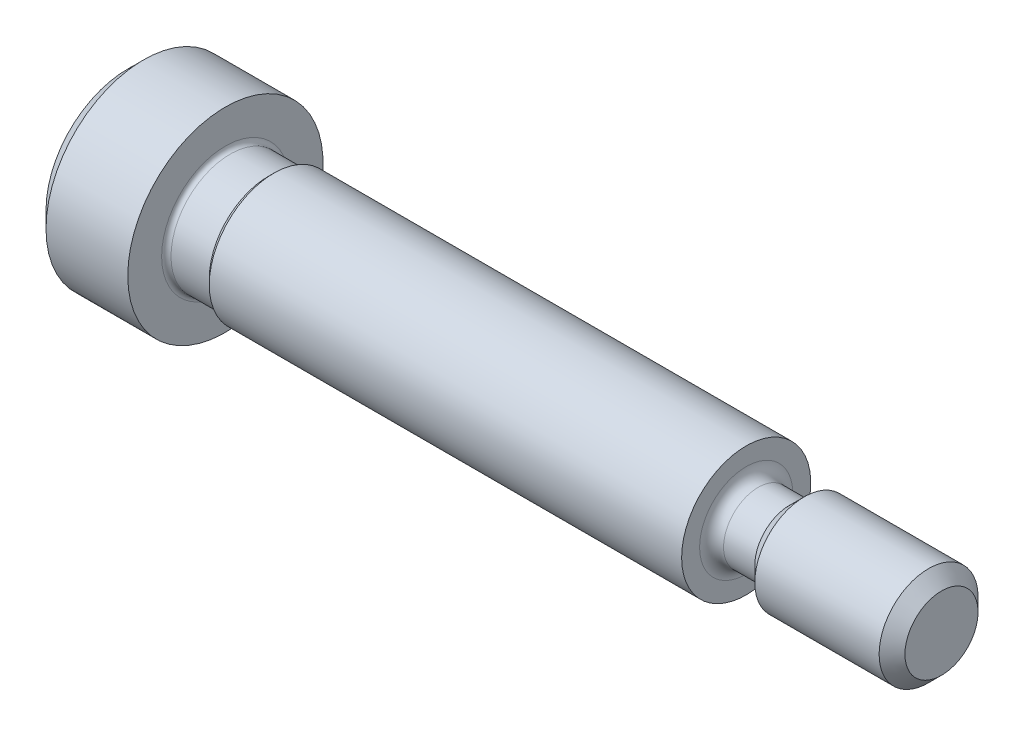
ISO-10303-21;
HEADER;
FILE_DESCRIPTION(('STEP AP214'),'2;1');
FILE_NAME('part.step','',(''),(''),'','','');
FILE_SCHEMA(('AUTOMOTIVE_DESIGN { 1 0 10303 214 1 1 1 1 }'));
ENDSEC;
DATA;
#1=APPLICATION_CONTEXT('core data for automotive mechanical design processes');
#2=APPLICATION_PROTOCOL_DEFINITION('international standard','automotive_design',2000,#1);
#3=PRODUCT_CONTEXT('',#1,'mechanical');
#4=PRODUCT('Part','Part','',(#3));
#5=PRODUCT_RELATED_PRODUCT_CATEGORY('part','',(#4));
#6=PRODUCT_DEFINITION_FORMATION('','',#4);
#7=PRODUCT_DEFINITION_CONTEXT('part definition',#1,'design');
#8=PRODUCT_DEFINITION('design','',#6,#7);
#9=PRODUCT_DEFINITION_SHAPE('','',#8);
#10=(LENGTH_UNIT() NAMED_UNIT(*) SI_UNIT(.MILLI.,.METRE.));
#11=(NAMED_UNIT(*) PLANE_ANGLE_UNIT() SI_UNIT($,.RADIAN.));
#12=(NAMED_UNIT(*) SI_UNIT($,.STERADIAN.) SOLID_ANGLE_UNIT());
#13=UNCERTAINTY_MEASURE_WITH_UNIT(LENGTH_MEASURE(1.E-05),#10,'distance_accuracy_value','');
#14=(GEOMETRIC_REPRESENTATION_CONTEXT(3) GLOBAL_UNCERTAINTY_ASSIGNED_CONTEXT((#13)) GLOBAL_UNIT_ASSIGNED_CONTEXT((#10,
#11,#12)) REPRESENTATION_CONTEXT('',''));
#15=CARTESIAN_POINT('',(0.,0.,0.));
#16=DIRECTION('',(0.,0.,1.));
#17=DIRECTION('',(1.,0.,0.));
#18=AXIS2_PLACEMENT_3D('',#15,#16,#17);
#19=CARTESIAN_POINT('',(0.,0.,0.));
#20=DIRECTION('',(-1.,0.,0.));
#21=DIRECTION('',(0.,0.,1.));
#22=AXIS2_PLACEMENT_3D('',#19,#20,#21);
#23=PLANE('',#22);
#24=CARTESIAN_POINT('',(0.,0.,0.));
#25=DIRECTION('',(-1.,0.,0.));
#26=DIRECTION('',(0.,0.,1.));
#27=AXIS2_PLACEMENT_3D('',#24,#25,#26);
#28=CIRCLE('',#27,3.9751);
#29=CARTESIAN_POINT('',(0.,0.,3.9751));
#30=VERTEX_POINT('',#29);
#31=EDGE_CURVE('E11',#30,#30,#28,.T.);
#32=ORIENTED_EDGE('',*,*,#31,.T.);
#33=EDGE_LOOP('',(#32));
#34=FACE_BOUND('',#33,.T.);
#35=DIRECTION('',(0.,-0.500000000000002,-0.866025403784438));
#36=VECTOR('',#35,1.);
#37=CARTESIAN_POINT('',(0.,-0.916543552338525,1.5875));
#38=LINE('',#37,#36);
#39=CARTESIAN_POINT('',(0.,-0.916543552338525,1.5875));
#40=VERTEX_POINT('',#39);
#41=CARTESIAN_POINT('',(0.,-1.83308710467706,0.));
#42=VERTEX_POINT('',#41);
#43=EDGE_CURVE('E44',#40,#42,#38,.T.);
#44=ORIENTED_EDGE('',*,*,#43,.T.);
#45=DIRECTION('',(0.,0.500000000000002,-0.866025403784437));
#46=VECTOR('',#45,1.);
#47=CARTESIAN_POINT('',(0.,-1.83308710467706,0.));
#48=LINE('',#47,#46);
#49=CARTESIAN_POINT('',(0.,-0.916543552338525,-1.5875));
#50=VERTEX_POINT('',#49);
#51=EDGE_CURVE('E473',#42,#50,#48,.T.);
#52=ORIENTED_EDGE('',*,*,#51,.T.);
#53=DIRECTION('',(0.,1.,0.));
#54=VECTOR('',#53,1.);
#55=CARTESIAN_POINT('',(0.,-0.916543552338525,-1.5875));
#56=LINE('',#55,#54);
#57=CARTESIAN_POINT('',(0.,0.916543552338522,-1.5875));
#58=VERTEX_POINT('',#57);
#59=EDGE_CURVE('E124',#50,#58,#56,.T.);
#60=ORIENTED_EDGE('',*,*,#59,.T.);
#61=DIRECTION('',(0.,0.500000000000005,0.866025403784435));
#62=VECTOR('',#61,1.);
#63=CARTESIAN_POINT('',(0.,0.916543552338522,-1.5875));
#64=LINE('',#63,#62);
#65=CARTESIAN_POINT('',(0.,1.83308710467707,0.));
#66=VERTEX_POINT('',#65);
#67=EDGE_CURVE('E476',#58,#66,#64,.T.);
#68=ORIENTED_EDGE('',*,*,#67,.T.);
#69=DIRECTION('',(0.,-0.500000000000004,0.866025403784436));
#70=VECTOR('',#69,1.);
#71=CARTESIAN_POINT('',(0.,1.83308710467707,0.));
#72=LINE('',#71,#70);
#73=CARTESIAN_POINT('',(0.,0.916543552338522,1.5875));
#74=VERTEX_POINT('',#73);
#75=EDGE_CURVE('E478',#66,#74,#72,.T.);
#76=ORIENTED_EDGE('',*,*,#75,.T.);
#77=DIRECTION('',(0.,-1.,0.));
#78=VECTOR('',#77,1.);
#79=CARTESIAN_POINT('',(0.,0.916543552338522,1.5875));
#80=LINE('',#79,#78);
#81=EDGE_CURVE('E480',#74,#40,#80,.T.);
#82=ORIENTED_EDGE('',*,*,#81,.T.);
#83=EDGE_LOOP('',(#44,#52,#60,#68,#76,#82));
#84=FACE_BOUND('',#83,.T.);
#85=ADVANCED_FACE('F30',(#34,#84),#23,.T.);
#86=CARTESIAN_POINT('',(0.,0.,0.));
#87=DIRECTION('',(1.,0.,0.));
#88=DIRECTION('',(0.,0.,-1.));
#89=AXIS2_PLACEMENT_3D('',#86,#87,#88);
#90=CONICAL_SURFACE('',#89,3.9751,0.78539816339745);
#91=CARTESIAN_POINT('',(0.787399999999999,0.,0.));
#92=DIRECTION('',(-1.,0.,0.));
#93=DIRECTION('',(0.,0.,1.));
#94=AXIS2_PLACEMENT_3D('',#91,#92,#93);
#95=CIRCLE('',#94,4.7625);
#96=CARTESIAN_POINT('',(0.787399999999999,0.,4.7625));
#97=VERTEX_POINT('',#96);
#98=EDGE_CURVE('E37',#97,#97,#95,.T.);
#99=ORIENTED_EDGE('',*,*,#98,.T.);
#100=EDGE_LOOP('',(#99));
#101=FACE_BOUND('',#100,.T.);
#102=ORIENTED_EDGE('',*,*,#31,.F.);
#103=EDGE_LOOP('',(#102));
#104=FACE_BOUND('',#103,.T.);
#105=ADVANCED_FACE('F176',(#101,#104),#90,.T.);
#106=CARTESIAN_POINT('',(-6.34999999999999,0.,0.));
#107=DIRECTION('',(-1.,0.,0.));
#108=DIRECTION('',(0.,0.,1.));
#109=AXIS2_PLACEMENT_3D('',#106,#107,#108);
#110=CYLINDRICAL_SURFACE('',#109,4.7625);
#111=CARTESIAN_POINT('',(4.7752,0.,0.));
#112=DIRECTION('',(-1.,0.,0.));
#113=DIRECTION('',(0.,0.,1.));
#114=AXIS2_PLACEMENT_3D('',#111,#112,#113);
#115=CIRCLE('',#114,4.7625);
#116=CARTESIAN_POINT('',(4.7752,0.,4.7625));
#117=VERTEX_POINT('',#116);
#118=EDGE_CURVE('E171',#117,#117,#115,.T.);
#119=ORIENTED_EDGE('',*,*,#118,.T.);
#120=EDGE_LOOP('',(#119));
#121=FACE_BOUND('',#120,.T.);
#122=ORIENTED_EDGE('',*,*,#98,.F.);
#123=EDGE_LOOP('',(#122));
#124=FACE_BOUND('',#123,.T.);
#125=ADVANCED_FACE('F179',(#121,#124),#110,.T.);
#126=CARTESIAN_POINT('',(4.7752,4.7625,0.));
#127=DIRECTION('',(1.,0.,0.));
#128=DIRECTION('',(0.,0.,-1.));
#129=AXIS2_PLACEMENT_3D('',#126,#127,#128);
#130=PLANE('',#129);
#131=CARTESIAN_POINT('',(4.7752,0.,0.));
#132=DIRECTION('',(-1.,0.,0.));
#133=DIRECTION('',(0.,0.,1.));
#134=AXIS2_PLACEMENT_3D('',#131,#132,#133);
#135=CIRCLE('',#134,3.1115);
#136=CARTESIAN_POINT('',(4.7752,0.,3.1115));
#137=VERTEX_POINT('',#136);
#138=EDGE_CURVE('E168',#137,#137,#135,.T.);
#139=ORIENTED_EDGE('',*,*,#138,.T.);
#140=EDGE_LOOP('',(#139));
#141=FACE_BOUND('',#140,.T.);
#142=ORIENTED_EDGE('',*,*,#118,.F.);
#143=EDGE_LOOP('',(#142));
#144=FACE_BOUND('',#143,.T.);
#145=ADVANCED_FACE('F181',(#141,#144),#130,.T.);
#146=CARTESIAN_POINT('',(5.0038,0.,0.));
#147=DIRECTION('',(-1.,0.,0.));
#148=DIRECTION('',(0.,0.,1.));
#149=AXIS2_PLACEMENT_3D('',#146,#147,#148);
#150=TOROIDAL_SURFACE('',#149,3.1115,0.2286);
#151=ORIENTED_EDGE('',*,*,#138,.F.);
#152=EDGE_LOOP('',(#151));
#153=FACE_BOUND('',#152,.T.);
#154=CARTESIAN_POINT('',(5.0038,0.,0.));
#155=DIRECTION('',(-1.,0.,0.));
#156=DIRECTION('',(0.,0.,1.));
#157=AXIS2_PLACEMENT_3D('',#154,#155,#156);
#158=CIRCLE('',#157,2.8829);
#159=CARTESIAN_POINT('',(5.0038,0.,2.8829));
#160=VERTEX_POINT('',#159);
#161=EDGE_CURVE('E165',#160,#160,#158,.T.);
#162=ORIENTED_EDGE('',*,*,#161,.T.);
#163=EDGE_LOOP('',(#162));
#164=FACE_BOUND('',#163,.T.);
#165=ADVANCED_FACE('F188',(#153,#164),#150,.F.);
#166=CARTESIAN_POINT('',(-6.34999999999999,0.,0.));
#167=DIRECTION('',(-1.,0.,0.));
#168=DIRECTION('',(0.,0.,1.));
#169=AXIS2_PLACEMENT_3D('',#166,#167,#168);
#170=CYLINDRICAL_SURFACE('',#169,2.8829);
#171=CARTESIAN_POINT('',(6.8707,0.,0.));
#172=DIRECTION('',(-1.,0.,0.));
#173=DIRECTION('',(0.,0.,1.));
#174=AXIS2_PLACEMENT_3D('',#171,#172,#173);
#175=CIRCLE('',#174,2.8829);
#176=CARTESIAN_POINT('',(6.8707,0.,2.8829));
#177=VERTEX_POINT('',#176);
#178=EDGE_CURVE('E162',#177,#177,#175,.T.);
#179=ORIENTED_EDGE('',*,*,#178,.T.);
#180=EDGE_LOOP('',(#179));
#181=FACE_BOUND('',#180,.T.);
#182=ORIENTED_EDGE('',*,*,#161,.F.);
#183=EDGE_LOOP('',(#182));
#184=FACE_BOUND('',#183,.T.);
#185=ADVANCED_FACE('F221',(#181,#184),#170,.T.);
#186=CARTESIAN_POINT('',(6.8707,0.,0.));
#187=DIRECTION('',(1.,0.,0.));
#188=DIRECTION('',(0.,0.,-1.));
#189=AXIS2_PLACEMENT_3D('',#186,#187,#188);
#190=CONICAL_SURFACE('',#189,2.8829,0.785398163397452);
#191=CARTESIAN_POINT('',(7.1374,0.,0.));
#192=DIRECTION('',(-1.,0.,0.));
#193=DIRECTION('',(0.,0.,1.));
#194=AXIS2_PLACEMENT_3D('',#191,#192,#193);
#195=CIRCLE('',#194,3.1496);
#196=CARTESIAN_POINT('',(7.1374,0.,3.1496));
#197=VERTEX_POINT('',#196);
#198=EDGE_CURVE('E159',#197,#197,#195,.T.);
#199=ORIENTED_EDGE('',*,*,#198,.T.);
#200=EDGE_LOOP('',(#199));
#201=FACE_BOUND('',#200,.T.);
#202=ORIENTED_EDGE('',*,*,#178,.F.);
#203=EDGE_LOOP('',(#202));
#204=FACE_BOUND('',#203,.T.);
#205=ADVANCED_FACE('F231',(#201,#204),#190,.T.);
#206=CARTESIAN_POINT('',(-6.34999999999999,0.,0.));
#207=DIRECTION('',(-1.,0.,0.));
#208=DIRECTION('',(0.,0.,1.));
#209=AXIS2_PLACEMENT_3D('',#206,#207,#208);
#210=CYLINDRICAL_SURFACE('',#209,3.1496);
#211=CARTESIAN_POINT('',(30.1752,0.,0.));
#212=DIRECTION('',(-1.,0.,0.));
#213=DIRECTION('',(0.,0.,1.));
#214=AXIS2_PLACEMENT_3D('',#211,#212,#213);
#215=CIRCLE('',#214,3.1496);
#216=CARTESIAN_POINT('',(30.1752,0.,3.1496));
#217=VERTEX_POINT('',#216);
#218=EDGE_CURVE('E156',#217,#217,#215,.T.);
#219=ORIENTED_EDGE('',*,*,#218,.T.);
#220=EDGE_LOOP('',(#219));
#221=FACE_BOUND('',#220,.T.);
#222=ORIENTED_EDGE('',*,*,#198,.F.);
#223=EDGE_LOOP('',(#222));
#224=FACE_BOUND('',#223,.T.);
#225=ADVANCED_FACE('F241',(#221,#224),#210,.T.);
#226=CARTESIAN_POINT('',(30.1752,3.1496,0.));
#227=DIRECTION('',(1.,0.,0.));
#228=DIRECTION('',(0.,0.,-1.));
#229=AXIS2_PLACEMENT_3D('',#226,#227,#228);
#230=PLANE('',#229);
#231=CARTESIAN_POINT('',(30.1752,0.,0.));
#232=DIRECTION('',(-1.,0.,0.));
#233=DIRECTION('',(0.,0.,1.));
#234=AXIS2_PLACEMENT_3D('',#231,#232,#233);
#235=CIRCLE('',#234,2.2733);
#236=CARTESIAN_POINT('',(30.1752,0.,2.2733));
#237=VERTEX_POINT('',#236);
#238=EDGE_CURVE('E153',#237,#237,#235,.T.);
#239=ORIENTED_EDGE('',*,*,#238,.T.);
#240=EDGE_LOOP('',(#239));
#241=FACE_BOUND('',#240,.T.);
#242=ORIENTED_EDGE('',*,*,#218,.F.);
#243=EDGE_LOOP('',(#242));
#244=FACE_BOUND('',#243,.T.);
#245=ADVANCED_FACE('F251',(#241,#244),#230,.T.);
#246=CARTESIAN_POINT('',(30.7594,0.,0.));
#247=DIRECTION('',(-1.,0.,0.));
#248=DIRECTION('',(0.,0.,1.));
#249=AXIS2_PLACEMENT_3D('',#246,#247,#248);
#250=TOROIDAL_SURFACE('',#249,2.2733,0.584200000000002);
#251=CARTESIAN_POINT('',(30.7594,0.,0.));
#252=DIRECTION('',(-1.,0.,0.));
#253=DIRECTION('',(0.,0.,1.));
#254=AXIS2_PLACEMENT_3D('',#251,#252,#253);
#255=CIRCLE('',#254,1.6891);
#256=CARTESIAN_POINT('',(30.7594,0.,1.6891));
#257=VERTEX_POINT('',#256);
#258=EDGE_CURVE('E150',#257,#257,#255,.T.);
#259=ORIENTED_EDGE('',*,*,#258,.T.);
#260=EDGE_LOOP('',(#259));
#261=FACE_BOUND('',#260,.T.);
#262=ORIENTED_EDGE('',*,*,#238,.F.);
#263=EDGE_LOOP('',(#262));
#264=FACE_BOUND('',#263,.T.);
#265=ADVANCED_FACE('F261',(#261,#264),#250,.F.);
#266=CARTESIAN_POINT('',(-6.34999999999999,0.,0.));
#267=DIRECTION('',(-1.,0.,0.));
#268=DIRECTION('',(0.,0.,1.));
#269=AXIS2_PLACEMENT_3D('',#266,#267,#268);
#270=CYLINDRICAL_SURFACE('',#269,1.6891);
#271=CARTESIAN_POINT('',(32.2834,0.,0.));
#272=DIRECTION('',(-1.,0.,0.));
#273=DIRECTION('',(0.,0.,1.));
#274=AXIS2_PLACEMENT_3D('',#271,#272,#273);
#275=CIRCLE('',#274,1.6891);
#276=CARTESIAN_POINT('',(32.2834,0.,1.6891));
#277=VERTEX_POINT('',#276);
#278=EDGE_CURVE('E147',#277,#277,#275,.T.);
#279=ORIENTED_EDGE('',*,*,#278,.T.);
#280=EDGE_LOOP('',(#279));
#281=FACE_BOUND('',#280,.T.);
#282=ORIENTED_EDGE('',*,*,#258,.F.);
#283=EDGE_LOOP('',(#282));
#284=FACE_BOUND('',#283,.T.);
#285=ADVANCED_FACE('F271',(#281,#284),#270,.T.);
#286=CARTESIAN_POINT('',(32.2834,0.,0.));
#287=DIRECTION('',(1.,0.,0.));
#288=DIRECTION('',(0.,0.,-1.));
#289=AXIS2_PLACEMENT_3D('',#286,#287,#288);
#290=CONICAL_SURFACE('',#289,1.6891,0.78539816339745);
#291=CARTESIAN_POINT('',(33.0073,0.,0.));
#292=DIRECTION('',(-1.,0.,0.));
#293=DIRECTION('',(0.,0.,1.));
#294=AXIS2_PLACEMENT_3D('',#291,#292,#293);
#295=CIRCLE('',#294,2.413);
#296=CARTESIAN_POINT('',(33.0073,0.,2.413));
#297=VERTEX_POINT('',#296);
#298=EDGE_CURVE('E144',#297,#297,#295,.T.);
#299=ORIENTED_EDGE('',*,*,#298,.T.);
#300=EDGE_LOOP('',(#299));
#301=FACE_BOUND('',#300,.T.);
#302=ORIENTED_EDGE('',*,*,#278,.F.);
#303=EDGE_LOOP('',(#302));
#304=FACE_BOUND('',#303,.T.);
#305=ADVANCED_FACE('F281',(#301,#304),#290,.T.);
#306=CARTESIAN_POINT('',(-6.34999999999999,0.,0.));
#307=DIRECTION('',(-1.,0.,0.));
#308=DIRECTION('',(0.,0.,1.));
#309=AXIS2_PLACEMENT_3D('',#306,#307,#308);
#310=CYLINDRICAL_SURFACE('',#309,2.413);
#311=CARTESIAN_POINT('',(39.07028,0.,0.));
#312=DIRECTION('',(-1.,0.,0.));
#313=DIRECTION('',(0.,0.,1.));
#314=AXIS2_PLACEMENT_3D('',#311,#312,#313);
#315=CIRCLE('',#314,2.413);
#316=CARTESIAN_POINT('',(39.07028,0.,2.413));
#317=VERTEX_POINT('',#316);
#318=EDGE_CURVE('E141',#317,#317,#315,.T.);
#319=ORIENTED_EDGE('',*,*,#318,.T.);
#320=EDGE_LOOP('',(#319));
#321=FACE_BOUND('',#320,.T.);
#322=ORIENTED_EDGE('',*,*,#298,.F.);
#323=EDGE_LOOP('',(#322));
#324=FACE_BOUND('',#323,.T.);
#325=ADVANCED_FACE('F291',(#321,#324),#310,.T.);
#326=CARTESIAN_POINT('',(39.07028,0.,0.));
#327=DIRECTION('',(-1.,0.,0.));
#328=DIRECTION('',(0.,0.,1.));
#329=AXIS2_PLACEMENT_3D('',#326,#327,#328);
#330=CONICAL_SURFACE('',#329,2.413,0.785398163397455);
#331=CARTESIAN_POINT('',(39.7002,0.,0.));
#332=DIRECTION('',(-1.,0.,0.));
#333=DIRECTION('',(0.,0.,1.));
#334=AXIS2_PLACEMENT_3D('',#331,#332,#333);
#335=CIRCLE('',#334,1.78308);
#336=CARTESIAN_POINT('',(39.7002,0.,1.78308));
#337=VERTEX_POINT('',#336);
#338=EDGE_CURVE('E137',#337,#337,#335,.T.);
#339=ORIENTED_EDGE('',*,*,#338,.T.);
#340=EDGE_LOOP('',(#339));
#341=FACE_BOUND('',#340,.T.);
#342=ORIENTED_EDGE('',*,*,#318,.F.);
#343=EDGE_LOOP('',(#342));
#344=FACE_BOUND('',#343,.T.);
#345=ADVANCED_FACE('F301',(#341,#344),#330,.T.);
#346=CARTESIAN_POINT('',(39.7002,1.78308,0.));
#347=DIRECTION('',(1.,0.,0.));
#348=DIRECTION('',(0.,0.,-1.));
#349=AXIS2_PLACEMENT_3D('',#346,#347,#348);
#350=PLANE('',#349);
#351=ORIENTED_EDGE('',*,*,#338,.F.);
#352=EDGE_LOOP('',(#351));
#353=FACE_BOUND('',#352,.T.);
#354=ADVANCED_FACE('F310',(#353),#350,.T.);
#355=CARTESIAN_POINT('',(2.3876,-1.83308710467706,0.));
#356=DIRECTION('',(0.,0.866025403784437,0.500000000000002));
#357=DIRECTION('',(0.,-0.500000000000003,0.866025403784437));
#358=AXIS2_PLACEMENT_3D('',#355,#356,#357);
#359=PLANE('',#358);
#360=DIRECTION('',(0.,0.500000000000002,-0.866025403784437));
#361=VECTOR('',#360,1.);
#362=CARTESIAN_POINT('',(2.3876,-1.83308710467706,0.));
#363=LINE('',#362,#361);
#364=CARTESIAN_POINT('',(2.3876,-1.83308710467706,0.));
#365=VERTEX_POINT('',#364);
#366=CARTESIAN_POINT('',(2.3876,-1.37481532850779,-0.793750000000003));
#367=VERTEX_POINT('',#366);
#368=EDGE_CURVE('E52',#365,#367,#363,.T.);
#369=ORIENTED_EDGE('',*,*,#368,.T.);
#370=CARTESIAN_POINT('',(2.3876,-0.916543552338525,-1.5875));
#371=VERTEX_POINT('',#370);
#372=EDGE_CURVE('E102',#367,#371,#363,.T.);
#373=ORIENTED_EDGE('',*,*,#372,.T.);
#374=DIRECTION('',(-1.,0.,0.));
#375=VECTOR('',#374,1.);
#376=CARTESIAN_POINT('',(2.3876,-0.916543552338525,-1.5875));
#377=LINE('',#376,#375);
#378=EDGE_CURVE('E106',#371,#50,#377,.T.);
#379=ORIENTED_EDGE('',*,*,#378,.T.);
#380=ORIENTED_EDGE('',*,*,#51,.F.);
#381=DIRECTION('',(-1.,0.,0.));
#382=VECTOR('',#381,1.);
#383=CARTESIAN_POINT('',(2.3876,-1.83308710467706,0.));
#384=LINE('',#383,#382);
#385=EDGE_CURVE('E472',#365,#42,#384,.T.);
#386=ORIENTED_EDGE('',*,*,#385,.F.);
#387=EDGE_LOOP('',(#369,#373,#379,#380,#386));
#388=FACE_BOUND('',#387,.T.);
#389=ADVANCED_FACE('F104',(#388),#359,.T.);
#390=CARTESIAN_POINT('',(2.3876,-0.916543552338525,-1.5875));
#391=DIRECTION('',(0.,0.,1.));
#392=DIRECTION('',(0.,-1.,0.));
#393=AXIS2_PLACEMENT_3D('',#390,#391,#392);
#394=PLANE('',#393);
#395=DIRECTION('',(0.,1.,0.));
#396=VECTOR('',#395,1.);
#397=CARTESIAN_POINT('',(2.3876,-0.916543552338525,-1.5875));
#398=LINE('',#397,#396);
#399=CARTESIAN_POINT('',(2.3876,0.,-1.5875));
#400=VERTEX_POINT('',#399);
#401=EDGE_CURVE('E111',#371,#400,#398,.T.);
#402=ORIENTED_EDGE('',*,*,#401,.T.);
#403=CARTESIAN_POINT('',(2.3876,0.916543552338522,-1.5875));
#404=VERTEX_POINT('',#403);
#405=EDGE_CURVE('E119',#400,#404,#398,.T.);
#406=ORIENTED_EDGE('',*,*,#405,.T.);
#407=DIRECTION('',(-1.,0.,0.));
#408=VECTOR('',#407,1.);
#409=CARTESIAN_POINT('',(2.3876,0.916543552338522,-1.5875));
#410=LINE('',#409,#408);
#411=EDGE_CURVE('E126',#404,#58,#410,.T.);
#412=ORIENTED_EDGE('',*,*,#411,.T.);
#413=ORIENTED_EDGE('',*,*,#59,.F.);
#414=ORIENTED_EDGE('',*,*,#378,.F.);
#415=EDGE_LOOP('',(#402,#406,#412,#413,#414));
#416=FACE_BOUND('',#415,.T.);
#417=ADVANCED_FACE('F122',(#416),#394,.T.);
#418=CARTESIAN_POINT('',(2.3876,0.916543552338522,-1.5875));
#419=DIRECTION('',(0.,-0.866025403784436,0.500000000000005));
#420=DIRECTION('',(0.,-0.500000000000005,-0.866025403784436));
#421=AXIS2_PLACEMENT_3D('',#418,#419,#420);
#422=PLANE('',#421);
#423=DIRECTION('',(0.,0.500000000000005,0.866025403784435));
#424=VECTOR('',#423,1.);
#425=CARTESIAN_POINT('',(2.3876,0.916543552338522,-1.5875));
#426=LINE('',#425,#424);
#427=CARTESIAN_POINT('',(2.3876,1.37481532850779,-0.793750000000007));
#428=VERTEX_POINT('',#427);
#429=EDGE_CURVE('E496',#404,#428,#426,.T.);
#430=ORIENTED_EDGE('',*,*,#429,.T.);
#431=CARTESIAN_POINT('',(2.3876,1.83308710467707,0.));
#432=VERTEX_POINT('',#431);
#433=EDGE_CURVE('E118',#428,#432,#426,.T.);
#434=ORIENTED_EDGE('',*,*,#433,.T.);
#435=DIRECTION('',(-1.,0.,0.));
#436=VECTOR('',#435,1.);
#437=CARTESIAN_POINT('',(2.3876,1.83308710467707,0.));
#438=LINE('',#437,#436);
#439=EDGE_CURVE('E132',#432,#66,#438,.T.);
#440=ORIENTED_EDGE('',*,*,#439,.T.);
#441=ORIENTED_EDGE('',*,*,#67,.F.);
#442=ORIENTED_EDGE('',*,*,#411,.F.);
#443=EDGE_LOOP('',(#430,#434,#440,#441,#442));
#444=FACE_BOUND('',#443,.T.);
#445=ADVANCED_FACE('F334',(#444),#422,.T.);
#446=CARTESIAN_POINT('',(2.3876,1.83308710467707,0.));
#447=DIRECTION('',(0.,-0.866025403784436,-0.500000000000004));
#448=DIRECTION('',(0.,0.500000000000004,-0.866025403784436));
#449=AXIS2_PLACEMENT_3D('',#446,#447,#448);
#450=PLANE('',#449);
#451=DIRECTION('',(0.,-0.500000000000004,0.866025403784436));
#452=VECTOR('',#451,1.);
#453=CARTESIAN_POINT('',(2.3876,1.83308710467707,0.));
#454=LINE('',#453,#452);
#455=CARTESIAN_POINT('',(2.3876,1.37481532850779,0.793750000000006));
#456=VERTEX_POINT('',#455);
#457=EDGE_CURVE('E461',#432,#456,#454,.T.);
#458=ORIENTED_EDGE('',*,*,#457,.T.);
#459=CARTESIAN_POINT('',(2.3876,0.916543552338522,1.5875));
#460=VERTEX_POINT('',#459);
#461=EDGE_CURVE('E452',#456,#460,#454,.T.);
#462=ORIENTED_EDGE('',*,*,#461,.T.);
#463=DIRECTION('',(-1.,0.,0.));
#464=VECTOR('',#463,1.);
#465=CARTESIAN_POINT('',(2.3876,0.916543552338522,1.5875));
#466=LINE('',#465,#464);
#467=EDGE_CURVE('E466',#460,#74,#466,.T.);
#468=ORIENTED_EDGE('',*,*,#467,.T.);
#469=ORIENTED_EDGE('',*,*,#75,.F.);
#470=ORIENTED_EDGE('',*,*,#439,.F.);
#471=EDGE_LOOP('',(#458,#462,#468,#469,#470));
#472=FACE_BOUND('',#471,.T.);
#473=ADVANCED_FACE('F341',(#472),#450,.T.);
#474=CARTESIAN_POINT('',(2.3876,0.916543552338522,1.5875));
#475=DIRECTION('',(0.,0.,-1.));
#476=DIRECTION('',(-1.,0.,0.));
#477=AXIS2_PLACEMENT_3D('',#474,#475,#476);
#478=PLANE('',#477);
#479=DIRECTION('',(0.,-1.,0.));
#480=VECTOR('',#479,1.);
#481=CARTESIAN_POINT('',(2.3876,0.916543552338522,1.5875));
#482=LINE('',#481,#480);
#483=CARTESIAN_POINT('',(2.3876,0.,1.5875));
#484=VERTEX_POINT('',#483);
#485=EDGE_CURVE('E451',#460,#484,#482,.T.);
#486=ORIENTED_EDGE('',*,*,#485,.T.);
#487=CARTESIAN_POINT('',(2.3876,-0.916543552338525,1.5875));
#488=VERTEX_POINT('',#487);
#489=EDGE_CURVE('E455',#484,#488,#482,.T.);
#490=ORIENTED_EDGE('',*,*,#489,.T.);
#491=DIRECTION('',(-1.,0.,0.));
#492=VECTOR('',#491,1.);
#493=CARTESIAN_POINT('',(2.3876,-0.916543552338525,1.5875));
#494=LINE('',#493,#492);
#495=EDGE_CURVE('E485',#488,#40,#494,.T.);
#496=ORIENTED_EDGE('',*,*,#495,.T.);
#497=ORIENTED_EDGE('',*,*,#81,.F.);
#498=ORIENTED_EDGE('',*,*,#467,.F.);
#499=EDGE_LOOP('',(#486,#490,#496,#497,#498));
#500=FACE_BOUND('',#499,.T.);
#501=ADVANCED_FACE('F349',(#500),#478,.T.);
#502=CARTESIAN_POINT('',(2.3876,-0.916543552338525,1.5875));
#503=DIRECTION('',(0.,0.866025403784438,-0.500000000000002));
#504=DIRECTION('',(0.,0.500000000000002,0.866025403784438));
#505=AXIS2_PLACEMENT_3D('',#502,#503,#504);
#506=PLANE('',#505);
#507=DIRECTION('',(0.,-0.500000000000002,-0.866025403784438));
#508=VECTOR('',#507,1.);
#509=CARTESIAN_POINT('',(2.3876,-0.916543552338525,1.5875));
#510=LINE('',#509,#508);
#511=CARTESIAN_POINT('',(2.3876,-1.37481532850779,0.793750000000002));
#512=VERTEX_POINT('',#511);
#513=EDGE_CURVE('E458',#488,#512,#510,.T.);
#514=ORIENTED_EDGE('',*,*,#513,.T.);
#515=EDGE_CURVE('E467',#512,#365,#510,.T.);
#516=ORIENTED_EDGE('',*,*,#515,.T.);
#517=ORIENTED_EDGE('',*,*,#385,.T.);
#518=ORIENTED_EDGE('',*,*,#43,.F.);
#519=ORIENTED_EDGE('',*,*,#495,.F.);
#520=EDGE_LOOP('',(#514,#516,#517,#518,#519));
#521=FACE_BOUND('',#520,.T.);
#522=ADVANCED_FACE('F357',(#521),#506,.T.);
#523=CARTESIAN_POINT('',(2.3876,0.,-3.17499999999997));
#524=DIRECTION('',(1.,0.,0.));
#525=DIRECTION('',(0.,0.,-1.));
#526=AXIS2_PLACEMENT_3D('',#523,#524,#525);
#527=PLANE('',#526);
#528=CARTESIAN_POINT('',(2.3876,0.,0.));
#529=DIRECTION('',(-1.,0.,0.));
#530=DIRECTION('',(0.,0.,1.));
#531=AXIS2_PLACEMENT_3D('',#528,#529,#530);
#532=CIRCLE('',#531,1.5875);
#533=EDGE_CURVE('E497',#428,#400,#532,.T.);
#534=ORIENTED_EDGE('',*,*,#533,.F.);
#535=ORIENTED_EDGE('',*,*,#429,.F.);
#536=ORIENTED_EDGE('',*,*,#405,.F.);
#537=EDGE_LOOP('',(#534,#535,#536));
#538=FACE_BOUND('',#537,.T.);
#539=ADVANCED_FACE('F365',(#538),#527,.F.);
#540=EDGE_CURVE('E138',#456,#428,#532,.T.);
#541=ORIENTED_EDGE('',*,*,#540,.F.);
#542=ORIENTED_EDGE('',*,*,#457,.F.);
#543=ORIENTED_EDGE('',*,*,#433,.F.);
#544=EDGE_LOOP('',(#541,#542,#543));
#545=FACE_BOUND('',#544,.T.);
#546=ADVANCED_FACE('F373',(#545),#527,.F.);
#547=EDGE_CURVE('E131',#484,#456,#532,.T.);
#548=ORIENTED_EDGE('',*,*,#547,.F.);
#549=ORIENTED_EDGE('',*,*,#485,.F.);
#550=ORIENTED_EDGE('',*,*,#461,.F.);
#551=EDGE_LOOP('',(#548,#549,#550));
#552=FACE_BOUND('',#551,.T.);
#553=ADVANCED_FACE('F381',(#552),#527,.F.);
#554=EDGE_CURVE('E125',#512,#484,#532,.T.);
#555=ORIENTED_EDGE('',*,*,#554,.F.);
#556=ORIENTED_EDGE('',*,*,#513,.F.);
#557=ORIENTED_EDGE('',*,*,#489,.F.);
#558=EDGE_LOOP('',(#555,#556,#557));
#559=FACE_BOUND('',#558,.T.);
#560=ADVANCED_FACE('F388',(#559),#527,.F.);
#561=EDGE_CURVE('E129',#367,#512,#532,.T.);
#562=ORIENTED_EDGE('',*,*,#561,.F.);
#563=ORIENTED_EDGE('',*,*,#368,.F.);
#564=ORIENTED_EDGE('',*,*,#515,.F.);
#565=EDGE_LOOP('',(#562,#563,#564));
#566=FACE_BOUND('',#565,.T.);
#567=ADVANCED_FACE('F395',(#566),#527,.F.);
#568=EDGE_CURVE('E114',#400,#367,#532,.T.);
#569=ORIENTED_EDGE('',*,*,#568,.F.);
#570=ORIENTED_EDGE('',*,*,#401,.F.);
#571=ORIENTED_EDGE('',*,*,#372,.F.);
#572=EDGE_LOOP('',(#569,#570,#571));
#573=FACE_BOUND('',#572,.T.);
#574=ADVANCED_FACE('F112',(#573),#527,.F.);
#575=CARTESIAN_POINT('',(3.30414355233854,0.,0.));
#576=DIRECTION('',(-1.,0.,0.));
#577=DIRECTION('',(0.,0.,1.));
#578=AXIS2_PLACEMENT_3D('',#575,#576,#577);
#579=CONICAL_SURFACE('',#578,0.,1.04719755119659);
#580=ORIENTED_EDGE('',*,*,#547,.T.);
#581=ORIENTED_EDGE('',*,*,#540,.T.);
#582=ORIENTED_EDGE('',*,*,#533,.T.);
#583=ORIENTED_EDGE('',*,*,#568,.T.);
#584=ORIENTED_EDGE('',*,*,#561,.T.);
#585=ORIENTED_EDGE('',*,*,#554,.T.);
#586=EDGE_LOOP('',(#580,#581,#582,#583,#584,#585));
#587=FACE_BOUND('',#586,.T.);
#588=CARTESIAN_POINT('',(3.30414355233854,0.,0.));
#589=VERTEX_POINT('',#588);
#590=VERTEX_LOOP('',#589);
#591=FACE_BOUND('',#590,.T.);
#592=ADVANCED_FACE('F408',(#587,#591),#579,.F.);
#593=CLOSED_SHELL('',(#85,#105,#125,#145,#165,#185,#205,#225,#245,#265,#285,#305,#325,#345,#354,
#389,#417,#445,#473,#501,#522,#539,#546,#553,#560,#567,#574,#592));
#594=MANIFOLD_SOLID_BREP('B2',#593);
#595=ADVANCED_BREP_SHAPE_REPRESENTATION('',(#18,#594),#14);
#596=SHAPE_DEFINITION_REPRESENTATION(#9,#595);
ENDSEC;
END-ISO-10303-21;
